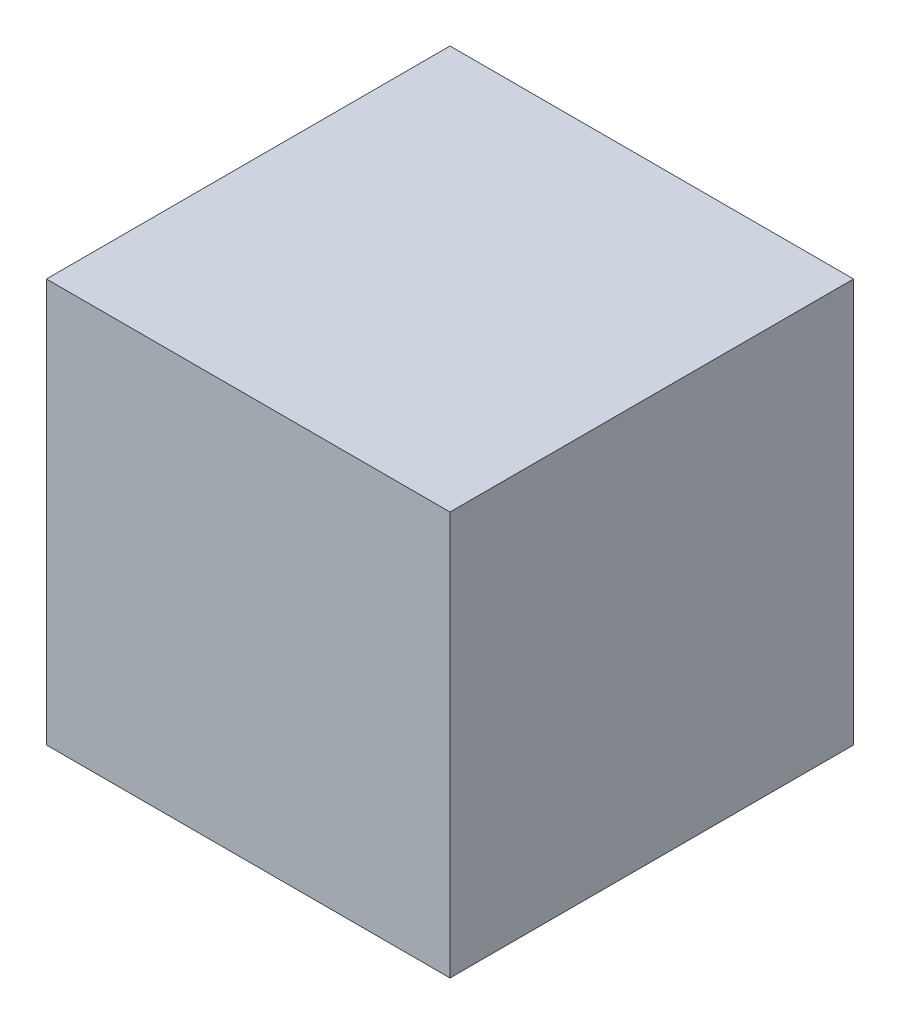
ISO-10303-21;
HEADER;
FILE_DESCRIPTION(('STEP AP214'),'2;1');
FILE_NAME('part.step','',(''),(''),'','','');
FILE_SCHEMA(('AUTOMOTIVE_DESIGN { 1 0 10303 214 1 1 1 1 }'));
ENDSEC;
DATA;
#1=APPLICATION_CONTEXT('core data for automotive mechanical design processes');
#2=APPLICATION_PROTOCOL_DEFINITION('international standard','automotive_design',2000,#1);
#3=PRODUCT_CONTEXT('',#1,'mechanical');
#4=PRODUCT('Part','Part','',(#3));
#5=PRODUCT_RELATED_PRODUCT_CATEGORY('part','',(#4));
#6=PRODUCT_DEFINITION_FORMATION('','',#4);
#7=PRODUCT_DEFINITION_CONTEXT('part definition',#1,'design');
#8=PRODUCT_DEFINITION('design','',#6,#7);
#9=PRODUCT_DEFINITION_SHAPE('','',#8);
#10=(LENGTH_UNIT() NAMED_UNIT(*) SI_UNIT(.MILLI.,.METRE.));
#11=(NAMED_UNIT(*) PLANE_ANGLE_UNIT() SI_UNIT($,.RADIAN.));
#12=(NAMED_UNIT(*) SI_UNIT($,.STERADIAN.) SOLID_ANGLE_UNIT());
#13=UNCERTAINTY_MEASURE_WITH_UNIT(LENGTH_MEASURE(1.E-05),#10,'distance_accuracy_value','');
#14=(GEOMETRIC_REPRESENTATION_CONTEXT(3) GLOBAL_UNCERTAINTY_ASSIGNED_CONTEXT((#13)) GLOBAL_UNIT_ASSIGNED_CONTEXT((#10,
#11,#12)) REPRESENTATION_CONTEXT('',''));
#15=CARTESIAN_POINT('',(0.,0.,0.));
#16=DIRECTION('',(0.,0.,1.));
#17=DIRECTION('',(1.,0.,0.));
#18=AXIS2_PLACEMENT_3D('',#15,#16,#17);
#19=CARTESIAN_POINT('',(0.,1000.,1000.));
#20=DIRECTION('',(1.,0.,0.));
#21=DIRECTION('',(0.,0.,-1.));
#22=AXIS2_PLACEMENT_3D('',#19,#20,#21);
#23=PLANE('',#22);
#24=DIRECTION('',(0.,-1.,0.));
#25=VECTOR('',#24,1.);
#26=CARTESIAN_POINT('',(0.,1000.,0.));
#27=LINE('',#26,#25);
#28=CARTESIAN_POINT('',(0.,1000.,0.));
#29=VERTEX_POINT('',#28);
#30=CARTESIAN_POINT('',(0.,0.,0.));
#31=VERTEX_POINT('',#30);
#32=EDGE_CURVE('E87',#29,#31,#27,.T.);
#33=ORIENTED_EDGE('',*,*,#32,.T.);
#34=DIRECTION('',(0.,0.,-1.));
#35=VECTOR('',#34,1.);
#36=CARTESIAN_POINT('',(0.,0.,1000.));
#37=LINE('',#36,#35);
#38=CARTESIAN_POINT('',(0.,0.,1000.));
#39=VERTEX_POINT('',#38);
#40=EDGE_CURVE('E11',#39,#31,#37,.T.);
#41=ORIENTED_EDGE('',*,*,#40,.F.);
#42=DIRECTION('',(0.,-1.,0.));
#43=VECTOR('',#42,1.);
#44=CARTESIAN_POINT('',(0.,1000.,1000.));
#45=LINE('',#44,#43);
#46=CARTESIAN_POINT('',(0.,1000.,1000.));
#47=VERTEX_POINT('',#46);
#48=EDGE_CURVE('E96',#47,#39,#45,.T.);
#49=ORIENTED_EDGE('',*,*,#48,.F.);
#50=DIRECTION('',(0.,0.,-1.));
#51=VECTOR('',#50,1.);
#52=CARTESIAN_POINT('',(0.,1000.,1000.));
#53=LINE('',#52,#51);
#54=EDGE_CURVE('E102',#47,#29,#53,.T.);
#55=ORIENTED_EDGE('',*,*,#54,.T.);
#56=EDGE_LOOP('',(#33,#41,#49,#55));
#57=FACE_BOUND('',#56,.T.);
#58=ADVANCED_FACE('F28',(#57),#23,.F.);
#59=CARTESIAN_POINT('',(0.,0.,1000.));
#60=DIRECTION('',(0.,1.,0.));
#61=DIRECTION('',(0.,0.,1.));
#62=AXIS2_PLACEMENT_3D('',#59,#60,#61);
#63=PLANE('',#62);
#64=DIRECTION('',(1.,0.,0.));
#65=VECTOR('',#64,1.);
#66=CARTESIAN_POINT('',(0.,0.,0.));
#67=LINE('',#66,#65);
#68=CARTESIAN_POINT('',(1000.,0.,0.));
#69=VERTEX_POINT('',#68);
#70=EDGE_CURVE('E90',#31,#69,#67,.T.);
#71=ORIENTED_EDGE('',*,*,#70,.T.);
#72=DIRECTION('',(0.,0.,-1.));
#73=VECTOR('',#72,1.);
#74=CARTESIAN_POINT('',(1000.,0.,1000.));
#75=LINE('',#74,#73);
#76=CARTESIAN_POINT('',(1000.,0.,1000.));
#77=VERTEX_POINT('',#76);
#78=EDGE_CURVE('E35',#77,#69,#75,.T.);
#79=ORIENTED_EDGE('',*,*,#78,.F.);
#80=DIRECTION('',(1.,0.,0.));
#81=VECTOR('',#80,1.);
#82=CARTESIAN_POINT('',(0.,0.,1000.));
#83=LINE('',#82,#81);
#84=EDGE_CURVE('E98',#39,#77,#83,.T.);
#85=ORIENTED_EDGE('',*,*,#84,.F.);
#86=ORIENTED_EDGE('',*,*,#40,.T.);
#87=EDGE_LOOP('',(#71,#79,#85,#86));
#88=FACE_BOUND('',#87,.T.);
#89=ADVANCED_FACE('F122',(#88),#63,.F.);
#90=CARTESIAN_POINT('',(1000.,0.,1000.));
#91=DIRECTION('',(-1.,0.,0.));
#92=DIRECTION('',(0.,0.,1.));
#93=AXIS2_PLACEMENT_3D('',#90,#91,#92);
#94=PLANE('',#93);
#95=DIRECTION('',(0.,1.,0.));
#96=VECTOR('',#95,1.);
#97=CARTESIAN_POINT('',(1000.,0.,0.));
#98=LINE('',#97,#96);
#99=CARTESIAN_POINT('',(1000.,1000.,0.));
#100=VERTEX_POINT('',#99);
#101=EDGE_CURVE('E92',#69,#100,#98,.T.);
#102=ORIENTED_EDGE('',*,*,#101,.T.);
#103=DIRECTION('',(0.,0.,-1.));
#104=VECTOR('',#103,1.);
#105=CARTESIAN_POINT('',(1000.,1000.,1000.));
#106=LINE('',#105,#104);
#107=CARTESIAN_POINT('',(1000.,1000.,1000.));
#108=VERTEX_POINT('',#107);
#109=EDGE_CURVE('E105',#108,#100,#106,.T.);
#110=ORIENTED_EDGE('',*,*,#109,.F.);
#111=DIRECTION('',(0.,1.,0.));
#112=VECTOR('',#111,1.);
#113=CARTESIAN_POINT('',(1000.,0.,1000.));
#114=LINE('',#113,#112);
#115=EDGE_CURVE('E47',#77,#108,#114,.T.);
#116=ORIENTED_EDGE('',*,*,#115,.F.);
#117=ORIENTED_EDGE('',*,*,#78,.T.);
#118=EDGE_LOOP('',(#102,#110,#116,#117));
#119=FACE_BOUND('',#118,.T.);
#120=ADVANCED_FACE('F111',(#119),#94,.F.);
#121=CARTESIAN_POINT('',(1000.,1000.,1000.));
#122=DIRECTION('',(0.,-1.,0.));
#123=DIRECTION('',(0.,0.,-1.));
#124=AXIS2_PLACEMENT_3D('',#121,#122,#123);
#125=PLANE('',#124);
#126=DIRECTION('',(-1.,0.,0.));
#127=VECTOR('',#126,1.);
#128=CARTESIAN_POINT('',(1000.,1000.,0.));
#129=LINE('',#128,#127);
#130=EDGE_CURVE('E94',#100,#29,#129,.T.);
#131=ORIENTED_EDGE('',*,*,#130,.T.);
#132=ORIENTED_EDGE('',*,*,#54,.F.);
#133=DIRECTION('',(-1.,0.,0.));
#134=VECTOR('',#133,1.);
#135=CARTESIAN_POINT('',(1000.,1000.,1000.));
#136=LINE('',#135,#134);
#137=EDGE_CURVE('E42',#108,#47,#136,.T.);
#138=ORIENTED_EDGE('',*,*,#137,.F.);
#139=ORIENTED_EDGE('',*,*,#109,.T.);
#140=EDGE_LOOP('',(#131,#132,#138,#139));
#141=FACE_BOUND('',#140,.T.);
#142=ADVANCED_FACE('F117',(#141),#125,.F.);
#143=CARTESIAN_POINT('',(0.,0.,1000.));
#144=DIRECTION('',(0.,0.,1.));
#145=DIRECTION('',(1.,0.,0.));
#146=AXIS2_PLACEMENT_3D('',#143,#144,#145);
#147=PLANE('',#146);
#148=ORIENTED_EDGE('',*,*,#48,.T.);
#149=ORIENTED_EDGE('',*,*,#84,.T.);
#150=ORIENTED_EDGE('',*,*,#115,.T.);
#151=ORIENTED_EDGE('',*,*,#137,.T.);
#152=EDGE_LOOP('',(#148,#149,#150,#151));
#153=FACE_BOUND('',#152,.T.);
#154=ADVANCED_FACE('F121',(#153),#147,.T.);
#155=CARTESIAN_POINT('',(0.,0.,0.));
#156=DIRECTION('',(0.,0.,1.));
#157=DIRECTION('',(1.,0.,0.));
#158=AXIS2_PLACEMENT_3D('',#155,#156,#157);
#159=PLANE('',#158);
#160=ORIENTED_EDGE('',*,*,#32,.F.);
#161=ORIENTED_EDGE('',*,*,#130,.F.);
#162=ORIENTED_EDGE('',*,*,#101,.F.);
#163=ORIENTED_EDGE('',*,*,#70,.F.);
#164=EDGE_LOOP('',(#160,#161,#162,#163));
#165=FACE_BOUND('',#164,.T.);
#166=ADVANCED_FACE('F83',(#165),#159,.F.);
#167=CLOSED_SHELL('',(#58,#89,#120,#142,#154,#166));
#168=CARTESIAN_POINT('',(500.,500.,500.));
#169=DIRECTION('',(0.,0.,1.));
#170=DIRECTION('',(-1.,0.,0.));
#171=AXIS2_PLACEMENT_3D('',#168,#169,#170);
#172=ELLIPSE('',#171,250.,250.);
#173=TRIMMED_CURVE('',#172,(PARAMETER_VALUE(3.14159265358979)),
(PARAMETER_VALUE(6.28318530717959)),.T.,.PARAMETER.);
#174=CARTESIAN_POINT('',(-1500.,500.,500.));
#175=DIRECTION('',(-1.,0.,0.));
#176=AXIS1_PLACEMENT('',#174,#175);
#177=SURFACE_OF_REVOLUTION('',#173,#176);
#178=CARTESIAN_POINT('',(250.,500.,500.));
#179=VERTEX_POINT('',#178);
#180=VERTEX_LOOP('',#179);
#181=FACE_BOUND('',#180,.T.);
#182=CARTESIAN_POINT('',(750.,500.,500.));
#183=VERTEX_POINT('',#182);
#184=VERTEX_LOOP('',#183);
#185=FACE_BOUND('',#184,.T.);
#186=ADVANCED_FACE('F72',(#181,#185),#177,.F.);
#187=CLOSED_SHELL('',(#186));
#188=ORIENTED_CLOSED_SHELL('',*,#187,.T.);
#189=BREP_WITH_VOIDS('B2',#167,(#188));
#190=ADVANCED_BREP_SHAPE_REPRESENTATION('',(#18,#189),#14);
#191=SHAPE_DEFINITION_REPRESENTATION(#9,#190);
ENDSEC;
END-ISO-10303-21;
